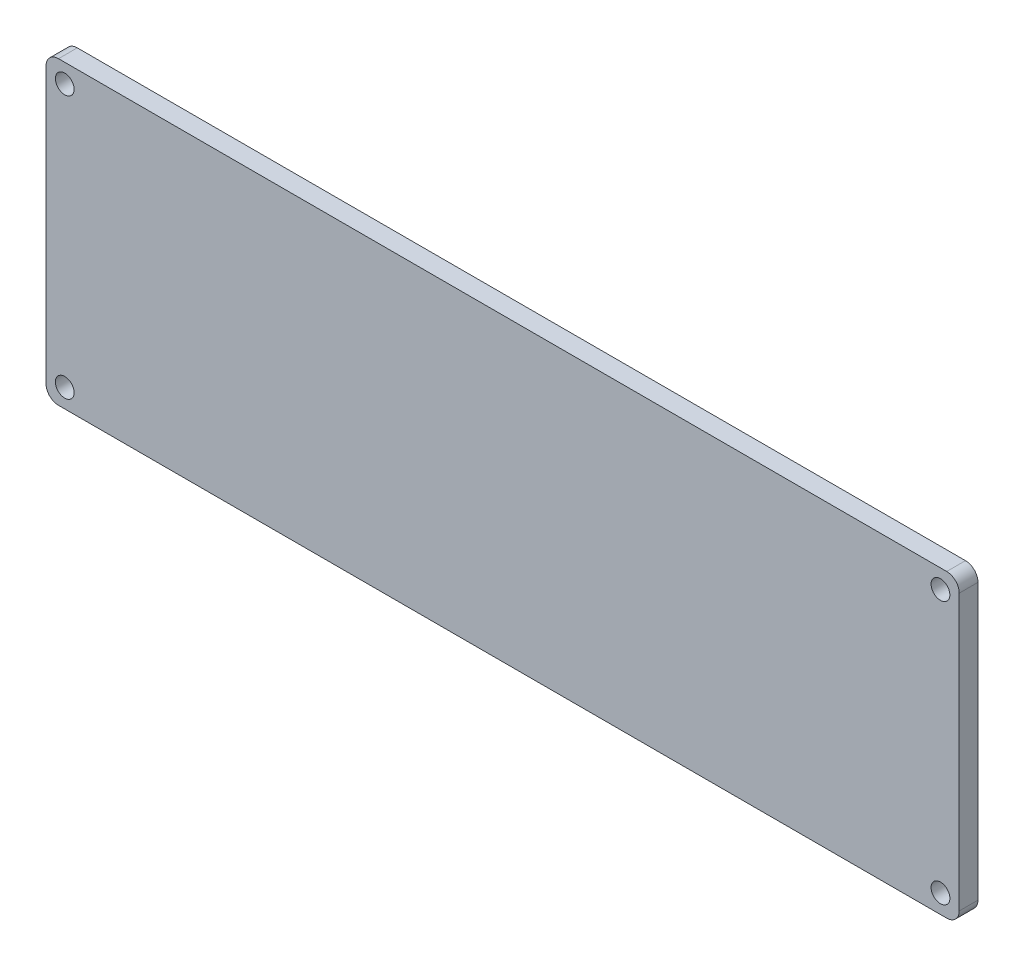
ISO-10303-21;
HEADER;
FILE_DESCRIPTION(('STEP AP214'),'2;1');
FILE_NAME('part.step','',(''),(''),'','','');
FILE_SCHEMA(('AUTOMOTIVE_DESIGN { 1 0 10303 214 1 1 1 1 }'));
ENDSEC;
DATA;
#1=APPLICATION_CONTEXT('core data for automotive mechanical design processes');
#2=APPLICATION_PROTOCOL_DEFINITION('international standard','automotive_design',2000,#1);
#3=PRODUCT_CONTEXT('',#1,'mechanical');
#4=PRODUCT('Part','Part','',(#3));
#5=PRODUCT_RELATED_PRODUCT_CATEGORY('part','',(#4));
#6=PRODUCT_DEFINITION_FORMATION('','',#4);
#7=PRODUCT_DEFINITION_CONTEXT('part definition',#1,'design');
#8=PRODUCT_DEFINITION('design','',#6,#7);
#9=PRODUCT_DEFINITION_SHAPE('','',#8);
#10=(LENGTH_UNIT() NAMED_UNIT(*) SI_UNIT(.MILLI.,.METRE.));
#11=(NAMED_UNIT(*) PLANE_ANGLE_UNIT() SI_UNIT($,.RADIAN.));
#12=(NAMED_UNIT(*) SI_UNIT($,.STERADIAN.) SOLID_ANGLE_UNIT());
#13=UNCERTAINTY_MEASURE_WITH_UNIT(LENGTH_MEASURE(1.E-05),#10,'distance_accuracy_value','');
#14=(GEOMETRIC_REPRESENTATION_CONTEXT(3) GLOBAL_UNCERTAINTY_ASSIGNED_CONTEXT((#13)) GLOBAL_UNIT_ASSIGNED_CONTEXT((#10,
#11,#12)) REPRESENTATION_CONTEXT('',''));
#15=CARTESIAN_POINT('',(0.,0.,0.));
#16=DIRECTION('',(0.,0.,1.));
#17=DIRECTION('',(1.,0.,0.));
#18=AXIS2_PLACEMENT_3D('',#15,#16,#17);
#19=CARTESIAN_POINT('',(0.,0.,3.));
#20=DIRECTION('',(0.,1.,0.));
#21=DIRECTION('',(0.,0.,1.));
#22=AXIS2_PLACEMENT_3D('',#19,#20,#21);
#23=PLANE('',#22);
#24=DIRECTION('',(1.,0.,0.));
#25=VECTOR('',#24,1.);
#26=CARTESIAN_POINT('',(0.,0.,3.));
#27=LINE('',#26,#25);
#28=CARTESIAN_POINT('',(2.,0.,3.));
#29=VERTEX_POINT('',#28);
#30=CARTESIAN_POINT('',(144.,0.,3.));
#31=VERTEX_POINT('',#30);
#32=EDGE_CURVE('E126',#29,#31,#27,.T.);
#33=ORIENTED_EDGE('',*,*,#32,.F.);
#34=DIRECTION('',(0.,0.,-1.));
#35=VECTOR('',#34,1.);
#36=CARTESIAN_POINT('',(2.,0.,0.));
#37=LINE('',#36,#35);
#38=CARTESIAN_POINT('',(2.,0.,0.));
#39=VERTEX_POINT('',#38);
#40=EDGE_CURVE('E111',#29,#39,#37,.T.);
#41=ORIENTED_EDGE('',*,*,#40,.T.);
#42=DIRECTION('',(1.,0.,0.));
#43=VECTOR('',#42,1.);
#44=CARTESIAN_POINT('',(0.,0.,0.));
#45=LINE('',#44,#43);
#46=CARTESIAN_POINT('',(144.,0.,0.));
#47=VERTEX_POINT('',#46);
#48=EDGE_CURVE('E123',#39,#47,#45,.T.);
#49=ORIENTED_EDGE('',*,*,#48,.T.);
#50=DIRECTION('',(0.,0.,-1.));
#51=VECTOR('',#50,1.);
#52=CARTESIAN_POINT('',(144.,0.,3.));
#53=LINE('',#52,#51);
#54=EDGE_CURVE('E128',#47,#31,#53,.F.);
#55=ORIENTED_EDGE('',*,*,#54,.T.);
#56=EDGE_LOOP('',(#33,#41,#49,#55));
#57=FACE_BOUND('',#56,.T.);
#58=ADVANCED_FACE('F41',(#57),#23,.F.);
#59=CARTESIAN_POINT('',(146.,0.,3.));
#60=DIRECTION('',(-1.,0.,0.));
#61=DIRECTION('',(0.,0.,1.));
#62=AXIS2_PLACEMENT_3D('',#59,#60,#61);
#63=PLANE('',#62);
#64=DIRECTION('',(0.,1.,0.));
#65=VECTOR('',#64,1.);
#66=CARTESIAN_POINT('',(146.,0.,3.));
#67=LINE('',#66,#65);
#68=CARTESIAN_POINT('',(146.,2.,3.));
#69=VERTEX_POINT('',#68);
#70=CARTESIAN_POINT('',(146.,46.,3.));
#71=VERTEX_POINT('',#70);
#72=EDGE_CURVE('E173',#69,#71,#67,.T.);
#73=ORIENTED_EDGE('',*,*,#72,.F.);
#74=DIRECTION('',(0.,0.,-1.));
#75=VECTOR('',#74,1.);
#76=CARTESIAN_POINT('',(146.,2.,3.));
#77=LINE('',#76,#75);
#78=CARTESIAN_POINT('',(146.,2.,0.));
#79=VERTEX_POINT('',#78);
#80=EDGE_CURVE('E166',#69,#79,#77,.T.);
#81=ORIENTED_EDGE('',*,*,#80,.T.);
#82=DIRECTION('',(0.,1.,0.));
#83=VECTOR('',#82,1.);
#84=CARTESIAN_POINT('',(146.,0.,0.));
#85=LINE('',#84,#83);
#86=CARTESIAN_POINT('',(146.,46.,0.));
#87=VERTEX_POINT('',#86);
#88=EDGE_CURVE('E132',#79,#87,#85,.T.);
#89=ORIENTED_EDGE('',*,*,#88,.T.);
#90=DIRECTION('',(0.,0.,-1.));
#91=VECTOR('',#90,1.);
#92=CARTESIAN_POINT('',(146.,46.,3.));
#93=LINE('',#92,#91);
#94=EDGE_CURVE('E164',#87,#71,#93,.F.);
#95=ORIENTED_EDGE('',*,*,#94,.T.);
#96=EDGE_LOOP('',(#73,#81,#89,#95));
#97=FACE_BOUND('',#96,.T.);
#98=ADVANCED_FACE('F171',(#97),#63,.F.);
#99=CARTESIAN_POINT('',(0.,48.,3.));
#100=DIRECTION('',(0.,1.,0.));
#101=DIRECTION('',(0.,0.,1.));
#102=AXIS2_PLACEMENT_3D('',#99,#100,#101);
#103=PLANE('',#102);
#104=DIRECTION('',(1.,0.,0.));
#105=VECTOR('',#104,1.);
#106=CARTESIAN_POINT('',(0.,48.,3.));
#107=LINE('',#106,#105);
#108=CARTESIAN_POINT('',(2.,48.,3.));
#109=VERTEX_POINT('',#108);
#110=CARTESIAN_POINT('',(144.,48.,3.));
#111=VERTEX_POINT('',#110);
#112=EDGE_CURVE('E180',#109,#111,#107,.T.);
#113=ORIENTED_EDGE('',*,*,#112,.T.);
#114=DIRECTION('',(0.,0.,-1.));
#115=VECTOR('',#114,1.);
#116=CARTESIAN_POINT('',(144.,48.,0.));
#117=LINE('',#116,#115);
#118=CARTESIAN_POINT('',(144.,48.,0.));
#119=VERTEX_POINT('',#118);
#120=EDGE_CURVE('E11',#111,#119,#117,.T.);
#121=ORIENTED_EDGE('',*,*,#120,.T.);
#122=DIRECTION('',(1.,0.,0.));
#123=VECTOR('',#122,1.);
#124=CARTESIAN_POINT('',(0.,48.,0.));
#125=LINE('',#124,#123);
#126=CARTESIAN_POINT('',(2.,48.,0.));
#127=VERTEX_POINT('',#126);
#128=EDGE_CURVE('E136',#127,#119,#125,.T.);
#129=ORIENTED_EDGE('',*,*,#128,.F.);
#130=DIRECTION('',(0.,0.,-1.));
#131=VECTOR('',#130,1.);
#132=CARTESIAN_POINT('',(2.,48.,3.));
#133=LINE('',#132,#131);
#134=EDGE_CURVE('E49',#127,#109,#133,.F.);
#135=ORIENTED_EDGE('',*,*,#134,.T.);
#136=EDGE_LOOP('',(#113,#121,#129,#135));
#137=FACE_BOUND('',#136,.T.);
#138=ADVANCED_FACE('F179',(#137),#103,.T.);
#139=CARTESIAN_POINT('',(3.,3.,3.));
#140=DIRECTION('',(0.,0.,-1.));
#141=DIRECTION('',(-1.,0.,0.));
#142=AXIS2_PLACEMENT_3D('',#139,#140,#141);
#143=CYLINDRICAL_SURFACE('',#142,1.5);
#144=CARTESIAN_POINT('',(3.,3.,3.));
#145=DIRECTION('',(0.,0.,1.));
#146=DIRECTION('',(1.,0.,0.));
#147=AXIS2_PLACEMENT_3D('',#144,#145,#146);
#148=CIRCLE('',#147,1.5);
#149=CARTESIAN_POINT('',(4.5,3.,3.));
#150=VERTEX_POINT('',#149);
#151=EDGE_CURVE('E248',#150,#150,#148,.T.);
#152=ORIENTED_EDGE('',*,*,#151,.T.);
#153=EDGE_LOOP('',(#152));
#154=FACE_BOUND('',#153,.T.);
#155=CARTESIAN_POINT('',(3.,3.,0.));
#156=DIRECTION('',(0.,0.,1.));
#157=DIRECTION('',(1.,0.,0.));
#158=AXIS2_PLACEMENT_3D('',#155,#156,#157);
#159=CIRCLE('',#158,1.5);
#160=CARTESIAN_POINT('',(4.5,3.,0.));
#161=VERTEX_POINT('',#160);
#162=EDGE_CURVE('E133',#161,#161,#159,.T.);
#163=ORIENTED_EDGE('',*,*,#162,.F.);
#164=EDGE_LOOP('',(#163));
#165=FACE_BOUND('',#164,.T.);
#166=ADVANCED_FACE('F201',(#154,#165),#143,.F.);
#167=CARTESIAN_POINT('',(143.,45.,3.));
#168=DIRECTION('',(0.,0.,-1.));
#169=DIRECTION('',(-1.,0.,0.));
#170=AXIS2_PLACEMENT_3D('',#167,#168,#169);
#171=CYLINDRICAL_SURFACE('',#170,1.5);
#172=CARTESIAN_POINT('',(143.,45.,3.));
#173=DIRECTION('',(0.,0.,1.));
#174=DIRECTION('',(1.,0.,0.));
#175=AXIS2_PLACEMENT_3D('',#172,#173,#174);
#176=CIRCLE('',#175,1.5);
#177=CARTESIAN_POINT('',(144.5,45.,3.));
#178=VERTEX_POINT('',#177);
#179=EDGE_CURVE('E245',#178,#178,#176,.T.);
#180=ORIENTED_EDGE('',*,*,#179,.T.);
#181=EDGE_LOOP('',(#180));
#182=FACE_BOUND('',#181,.T.);
#183=CARTESIAN_POINT('',(143.,45.,0.));
#184=DIRECTION('',(0.,0.,1.));
#185=DIRECTION('',(1.,0.,0.));
#186=AXIS2_PLACEMENT_3D('',#183,#184,#185);
#187=CIRCLE('',#186,1.5);
#188=CARTESIAN_POINT('',(144.5,45.,0.));
#189=VERTEX_POINT('',#188);
#190=EDGE_CURVE('E139',#189,#189,#187,.T.);
#191=ORIENTED_EDGE('',*,*,#190,.F.);
#192=EDGE_LOOP('',(#191));
#193=FACE_BOUND('',#192,.T.);
#194=ADVANCED_FACE('F198',(#182,#193),#171,.F.);
#195=CARTESIAN_POINT('',(3.,45.,3.));
#196=DIRECTION('',(0.,0.,-1.));
#197=DIRECTION('',(-1.,0.,0.));
#198=AXIS2_PLACEMENT_3D('',#195,#196,#197);
#199=CYLINDRICAL_SURFACE('',#198,1.5);
#200=CARTESIAN_POINT('',(3.,45.,3.));
#201=DIRECTION('',(0.,0.,1.));
#202=DIRECTION('',(1.,0.,0.));
#203=AXIS2_PLACEMENT_3D('',#200,#201,#202);
#204=CIRCLE('',#203,1.5);
#205=CARTESIAN_POINT('',(4.5,45.,3.));
#206=VERTEX_POINT('',#205);
#207=EDGE_CURVE('E242',#206,#206,#204,.T.);
#208=ORIENTED_EDGE('',*,*,#207,.T.);
#209=EDGE_LOOP('',(#208));
#210=FACE_BOUND('',#209,.T.);
#211=CARTESIAN_POINT('',(3.,45.,0.));
#212=DIRECTION('',(0.,0.,1.));
#213=DIRECTION('',(1.,0.,0.));
#214=AXIS2_PLACEMENT_3D('',#211,#212,#213);
#215=CIRCLE('',#214,1.5);
#216=CARTESIAN_POINT('',(4.5,45.,0.));
#217=VERTEX_POINT('',#216);
#218=EDGE_CURVE('E191',#217,#217,#215,.T.);
#219=ORIENTED_EDGE('',*,*,#218,.F.);
#220=EDGE_LOOP('',(#219));
#221=FACE_BOUND('',#220,.T.);
#222=ADVANCED_FACE('F200',(#210,#221),#199,.F.);
#223=CARTESIAN_POINT('',(143.,3.,3.));
#224=DIRECTION('',(0.,0.,-1.));
#225=DIRECTION('',(-1.,0.,0.));
#226=AXIS2_PLACEMENT_3D('',#223,#224,#225);
#227=CYLINDRICAL_SURFACE('',#226,1.5);
#228=CARTESIAN_POINT('',(143.,3.,3.));
#229=DIRECTION('',(0.,0.,1.));
#230=DIRECTION('',(1.,0.,0.));
#231=AXIS2_PLACEMENT_3D('',#228,#229,#230);
#232=CIRCLE('',#231,1.5);
#233=CARTESIAN_POINT('',(144.5,3.,3.));
#234=VERTEX_POINT('',#233);
#235=EDGE_CURVE('E147',#234,#234,#232,.T.);
#236=ORIENTED_EDGE('',*,*,#235,.T.);
#237=EDGE_LOOP('',(#236));
#238=FACE_BOUND('',#237,.T.);
#239=CARTESIAN_POINT('',(143.,3.,0.));
#240=DIRECTION('',(0.,0.,1.));
#241=DIRECTION('',(1.,0.,0.));
#242=AXIS2_PLACEMENT_3D('',#239,#240,#241);
#243=CIRCLE('',#242,1.5);
#244=CARTESIAN_POINT('',(144.5,3.,0.));
#245=VERTEX_POINT('',#244);
#246=EDGE_CURVE('E188',#245,#245,#243,.T.);
#247=ORIENTED_EDGE('',*,*,#246,.F.);
#248=EDGE_LOOP('',(#247));
#249=FACE_BOUND('',#248,.T.);
#250=ADVANCED_FACE('F208',(#238,#249),#227,.F.);
#251=CARTESIAN_POINT('',(0.,0.,3.));
#252=DIRECTION('',(-1.,0.,0.));
#253=DIRECTION('',(0.,0.,1.));
#254=AXIS2_PLACEMENT_3D('',#251,#252,#253);
#255=PLANE('',#254);
#256=DIRECTION('',(0.,1.,0.));
#257=VECTOR('',#256,1.);
#258=CARTESIAN_POINT('',(0.,0.,0.));
#259=LINE('',#258,#257);
#260=CARTESIAN_POINT('',(0.,2.,0.));
#261=VERTEX_POINT('',#260);
#262=CARTESIAN_POINT('',(0.,46.,0.));
#263=VERTEX_POINT('',#262);
#264=EDGE_CURVE('E145',#261,#263,#259,.T.);
#265=ORIENTED_EDGE('',*,*,#264,.F.);
#266=DIRECTION('',(0.,0.,-1.));
#267=VECTOR('',#266,1.);
#268=CARTESIAN_POINT('',(0.,2.,3.));
#269=LINE('',#268,#267);
#270=CARTESIAN_POINT('',(0.,2.,3.));
#271=VERTEX_POINT('',#270);
#272=EDGE_CURVE('E112',#261,#271,#269,.F.);
#273=ORIENTED_EDGE('',*,*,#272,.T.);
#274=DIRECTION('',(0.,1.,0.));
#275=VECTOR('',#274,1.);
#276=CARTESIAN_POINT('',(0.,0.,3.));
#277=LINE('',#276,#275);
#278=CARTESIAN_POINT('',(0.,46.,3.));
#279=VERTEX_POINT('',#278);
#280=EDGE_CURVE('E148',#271,#279,#277,.T.);
#281=ORIENTED_EDGE('',*,*,#280,.T.);
#282=DIRECTION('',(0.,0.,-1.));
#283=VECTOR('',#282,1.);
#284=CARTESIAN_POINT('',(0.,46.,3.));
#285=LINE('',#284,#283);
#286=EDGE_CURVE('E117',#279,#263,#285,.T.);
#287=ORIENTED_EDGE('',*,*,#286,.T.);
#288=EDGE_LOOP('',(#265,#273,#281,#287));
#289=FACE_BOUND('',#288,.T.);
#290=ADVANCED_FACE('F224',(#289),#255,.T.);
#291=CARTESIAN_POINT('',(0.,0.,3.));
#292=DIRECTION('',(0.,0.,1.));
#293=DIRECTION('',(1.,0.,0.));
#294=AXIS2_PLACEMENT_3D('',#291,#292,#293);
#295=PLANE('',#294);
#296=ORIENTED_EDGE('',*,*,#235,.F.);
#297=EDGE_LOOP('',(#296));
#298=FACE_BOUND('',#297,.T.);
#299=ORIENTED_EDGE('',*,*,#207,.F.);
#300=EDGE_LOOP('',(#299));
#301=FACE_BOUND('',#300,.T.);
#302=ORIENTED_EDGE('',*,*,#179,.F.);
#303=EDGE_LOOP('',(#302));
#304=FACE_BOUND('',#303,.T.);
#305=ORIENTED_EDGE('',*,*,#151,.F.);
#306=EDGE_LOOP('',(#305));
#307=FACE_BOUND('',#306,.T.);
#308=ORIENTED_EDGE('',*,*,#280,.F.);
#309=CARTESIAN_POINT('',(2.,2.,3.));
#310=DIRECTION('',(0.,0.,1.));
#311=DIRECTION('',(1.,0.,0.));
#312=AXIS2_PLACEMENT_3D('',#309,#310,#311);
#313=CIRCLE('',#312,2.);
#314=EDGE_CURVE('E162',#271,#29,#313,.T.);
#315=ORIENTED_EDGE('',*,*,#314,.T.);
#316=ORIENTED_EDGE('',*,*,#32,.T.);
#317=CARTESIAN_POINT('',(144.,2.,3.));
#318=DIRECTION('',(0.,0.,1.));
#319=DIRECTION('',(1.,0.,0.));
#320=AXIS2_PLACEMENT_3D('',#317,#318,#319);
#321=CIRCLE('',#320,2.);
#322=EDGE_CURVE('E160',#31,#69,#321,.T.);
#323=ORIENTED_EDGE('',*,*,#322,.T.);
#324=ORIENTED_EDGE('',*,*,#72,.T.);
#325=CARTESIAN_POINT('',(144.,46.,3.));
#326=DIRECTION('',(0.,0.,1.));
#327=DIRECTION('',(1.,0.,0.));
#328=AXIS2_PLACEMENT_3D('',#325,#326,#327);
#329=CIRCLE('',#328,2.);
#330=EDGE_CURVE('E56',#71,#111,#329,.T.);
#331=ORIENTED_EDGE('',*,*,#330,.T.);
#332=ORIENTED_EDGE('',*,*,#112,.F.);
#333=CARTESIAN_POINT('',(2.,46.,3.));
#334=DIRECTION('',(0.,0.,1.));
#335=DIRECTION('',(1.,0.,0.));
#336=AXIS2_PLACEMENT_3D('',#333,#334,#335);
#337=CIRCLE('',#336,2.);
#338=EDGE_CURVE('E157',#109,#279,#337,.T.);
#339=ORIENTED_EDGE('',*,*,#338,.T.);
#340=EDGE_LOOP('',(#308,#315,#316,#323,#324,#331,#332,#339));
#341=FACE_BOUND('',#340,.T.);
#342=ADVANCED_FACE('F227',(#298,#301,#304,#307,#341),#295,.T.);
#343=CARTESIAN_POINT('',(0.,0.,0.));
#344=DIRECTION('',(0.,0.,1.));
#345=DIRECTION('',(1.,0.,0.));
#346=AXIS2_PLACEMENT_3D('',#343,#344,#345);
#347=PLANE('',#346);
#348=ORIENTED_EDGE('',*,*,#246,.T.);
#349=EDGE_LOOP('',(#348));
#350=FACE_BOUND('',#349,.T.);
#351=ORIENTED_EDGE('',*,*,#218,.T.);
#352=EDGE_LOOP('',(#351));
#353=FACE_BOUND('',#352,.T.);
#354=ORIENTED_EDGE('',*,*,#190,.T.);
#355=EDGE_LOOP('',(#354));
#356=FACE_BOUND('',#355,.T.);
#357=ORIENTED_EDGE('',*,*,#162,.T.);
#358=EDGE_LOOP('',(#357));
#359=FACE_BOUND('',#358,.T.);
#360=ORIENTED_EDGE('',*,*,#48,.F.);
#361=CARTESIAN_POINT('',(2.,2.,0.));
#362=DIRECTION('',(0.,0.,1.));
#363=DIRECTION('',(1.,0.,0.));
#364=AXIS2_PLACEMENT_3D('',#361,#362,#363);
#365=CIRCLE('',#364,2.);
#366=EDGE_CURVE('E107',#39,#261,#365,.F.);
#367=ORIENTED_EDGE('',*,*,#366,.T.);
#368=ORIENTED_EDGE('',*,*,#264,.T.);
#369=CARTESIAN_POINT('',(2.,46.,0.));
#370=DIRECTION('',(0.,0.,1.));
#371=DIRECTION('',(1.,0.,0.));
#372=AXIS2_PLACEMENT_3D('',#369,#370,#371);
#373=CIRCLE('',#372,2.);
#374=EDGE_CURVE('E127',#263,#127,#373,.F.);
#375=ORIENTED_EDGE('',*,*,#374,.T.);
#376=ORIENTED_EDGE('',*,*,#128,.T.);
#377=CARTESIAN_POINT('',(144.,46.,0.));
#378=DIRECTION('',(0.,0.,1.));
#379=DIRECTION('',(1.,0.,0.));
#380=AXIS2_PLACEMENT_3D('',#377,#378,#379);
#381=CIRCLE('',#380,2.);
#382=EDGE_CURVE('E151',#119,#87,#381,.F.);
#383=ORIENTED_EDGE('',*,*,#382,.T.);
#384=ORIENTED_EDGE('',*,*,#88,.F.);
#385=CARTESIAN_POINT('',(144.,2.,0.));
#386=DIRECTION('',(0.,0.,1.));
#387=DIRECTION('',(1.,0.,0.));
#388=AXIS2_PLACEMENT_3D('',#385,#386,#387);
#389=CIRCLE('',#388,2.);
#390=EDGE_CURVE('E118',#79,#47,#389,.F.);
#391=ORIENTED_EDGE('',*,*,#390,.T.);
#392=EDGE_LOOP('',(#360,#367,#368,#375,#376,#383,#384,#391));
#393=FACE_BOUND('',#392,.T.);
#394=ADVANCED_FACE('F130',(#350,#353,#356,#359,#393),#347,.F.);
#395=CARTESIAN_POINT('',(2.,2.,3.));
#396=DIRECTION('',(0.,0.,1.));
#397=DIRECTION('',(1.,0.,0.));
#398=AXIS2_PLACEMENT_3D('',#395,#396,#397);
#399=CYLINDRICAL_SURFACE('',#398,2.);
#400=ORIENTED_EDGE('',*,*,#314,.F.);
#401=ORIENTED_EDGE('',*,*,#272,.F.);
#402=ORIENTED_EDGE('',*,*,#366,.F.);
#403=ORIENTED_EDGE('',*,*,#40,.F.);
#404=EDGE_LOOP('',(#400,#401,#402,#403));
#405=FACE_BOUND('',#404,.T.);
#406=ADVANCED_FACE('F110',(#405),#399,.T.);
#407=CARTESIAN_POINT('',(144.,2.,3.));
#408=DIRECTION('',(0.,0.,-1.));
#409=DIRECTION('',(-1.,0.,0.));
#410=AXIS2_PLACEMENT_3D('',#407,#408,#409);
#411=CYLINDRICAL_SURFACE('',#410,2.);
#412=ORIENTED_EDGE('',*,*,#322,.F.);
#413=ORIENTED_EDGE('',*,*,#54,.F.);
#414=ORIENTED_EDGE('',*,*,#390,.F.);
#415=ORIENTED_EDGE('',*,*,#80,.F.);
#416=EDGE_LOOP('',(#412,#413,#414,#415));
#417=FACE_BOUND('',#416,.T.);
#418=ADVANCED_FACE('F256',(#417),#411,.T.);
#419=CARTESIAN_POINT('',(144.,46.,3.));
#420=DIRECTION('',(0.,0.,1.));
#421=DIRECTION('',(1.,0.,0.));
#422=AXIS2_PLACEMENT_3D('',#419,#420,#421);
#423=CYLINDRICAL_SURFACE('',#422,2.);
#424=ORIENTED_EDGE('',*,*,#330,.F.);
#425=ORIENTED_EDGE('',*,*,#94,.F.);
#426=ORIENTED_EDGE('',*,*,#382,.F.);
#427=ORIENTED_EDGE('',*,*,#120,.F.);
#428=EDGE_LOOP('',(#424,#425,#426,#427));
#429=FACE_BOUND('',#428,.T.);
#430=ADVANCED_FACE('F178',(#429),#423,.T.);
#431=CARTESIAN_POINT('',(2.,46.,3.));
#432=DIRECTION('',(0.,0.,-1.));
#433=DIRECTION('',(-1.,0.,0.));
#434=AXIS2_PLACEMENT_3D('',#431,#432,#433);
#435=CYLINDRICAL_SURFACE('',#434,2.);
#436=ORIENTED_EDGE('',*,*,#338,.F.);
#437=ORIENTED_EDGE('',*,*,#134,.F.);
#438=ORIENTED_EDGE('',*,*,#374,.F.);
#439=ORIENTED_EDGE('',*,*,#286,.F.);
#440=EDGE_LOOP('',(#436,#437,#438,#439));
#441=FACE_BOUND('',#440,.T.);
#442=ADVANCED_FACE('F43',(#441),#435,.T.);
#443=CLOSED_SHELL('',(#58,#98,#138,#166,#194,#222,#250,#290,#342,#394,#406,#418,#430,#442));
#444=MANIFOLD_SOLID_BREP('B2',#443);
#445=ADVANCED_BREP_SHAPE_REPRESENTATION('',(#18,#444),#14);
#446=SHAPE_DEFINITION_REPRESENTATION(#9,#445);
ENDSEC;
END-ISO-10303-21;
